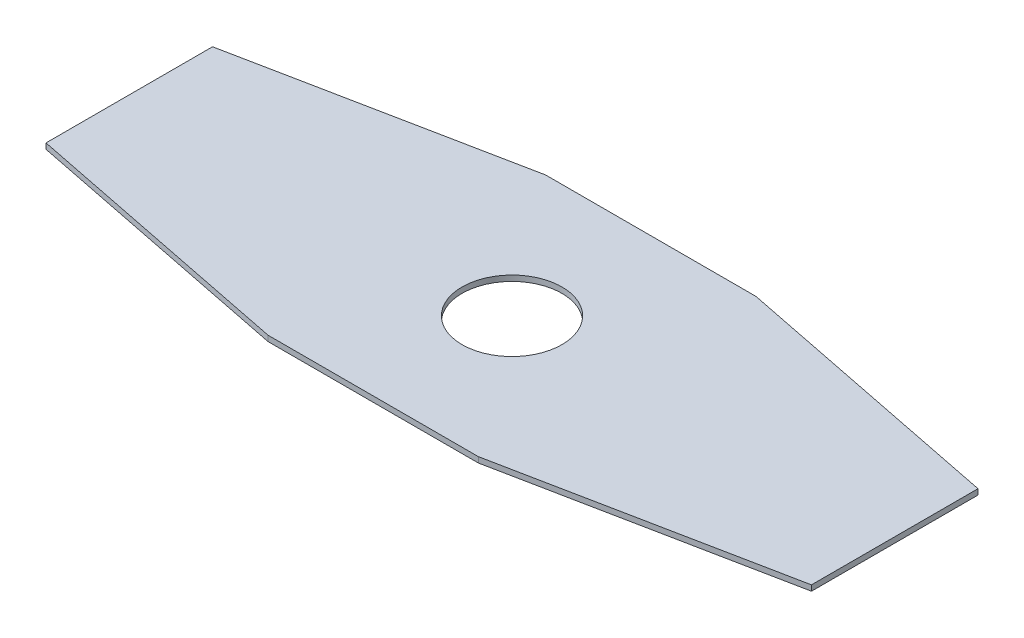
ISO-10303-21;
HEADER;
FILE_DESCRIPTION(('STEP AP214'),'2;1');
FILE_NAME('part.step','',(''),(''),'','','');
FILE_SCHEMA(('AUTOMOTIVE_DESIGN { 1 0 10303 214 1 1 1 1 }'));
ENDSEC;
DATA;
#1=APPLICATION_CONTEXT('core data for automotive mechanical design processes');
#2=APPLICATION_PROTOCOL_DEFINITION('international standard','automotive_design',2000,#1);
#3=PRODUCT_CONTEXT('',#1,'mechanical');
#4=PRODUCT('Part','Part','',(#3));
#5=PRODUCT_RELATED_PRODUCT_CATEGORY('part','',(#4));
#6=PRODUCT_DEFINITION_FORMATION('','',#4);
#7=PRODUCT_DEFINITION_CONTEXT('part definition',#1,'design');
#8=PRODUCT_DEFINITION('design','',#6,#7);
#9=PRODUCT_DEFINITION_SHAPE('','',#8);
#10=(LENGTH_UNIT() NAMED_UNIT(*) SI_UNIT(.MILLI.,.METRE.));
#11=(NAMED_UNIT(*) PLANE_ANGLE_UNIT() SI_UNIT($,.RADIAN.));
#12=(NAMED_UNIT(*) SI_UNIT($,.STERADIAN.) SOLID_ANGLE_UNIT());
#13=UNCERTAINTY_MEASURE_WITH_UNIT(LENGTH_MEASURE(1.E-05),#10,'distance_accuracy_value','');
#14=(GEOMETRIC_REPRESENTATION_CONTEXT(3) GLOBAL_UNCERTAINTY_ASSIGNED_CONTEXT((#13)) GLOBAL_UNIT_ASSIGNED_CONTEXT((#10,
#11,#12)) REPRESENTATION_CONTEXT('',''));
#15=CARTESIAN_POINT('',(0.,0.,0.));
#16=DIRECTION('',(0.,0.,1.));
#17=DIRECTION('',(1.,0.,0.));
#18=AXIS2_PLACEMENT_3D('',#15,#16,#17);
#19=CARTESIAN_POINT('',(-18.9450952168784,1.,25.));
#20=DIRECTION('',(0.196116135138184,0.,-0.98058067569092));
#21=DIRECTION('',(0.98058067569092,0.,0.196116135138184));
#22=AXIS2_PLACEMENT_3D('',#19,#20,#21);
#23=PLANE('',#22);
#24=DIRECTION('',(0.,1.,0.));
#25=VECTOR('',#24,1.);
#26=CARTESIAN_POINT('',(-68.9450952168784,1.,15.));
#27=LINE('',#26,#25);
#28=CARTESIAN_POINT('',(-68.9450952168783,0.,15.));
#29=VERTEX_POINT('',#28);
#30=CARTESIAN_POINT('',(-68.9450952168784,1.,15.));
#31=VERTEX_POINT('',#30);
#32=EDGE_CURVE('E11',#29,#31,#27,.T.);
#33=ORIENTED_EDGE('',*,*,#32,.F.);
#34=DIRECTION('',(0.98058067569092,0.,0.196116135138184));
#35=VECTOR('',#34,1.);
#36=CARTESIAN_POINT('',(-18.9450952168784,0.,25.));
#37=LINE('',#36,#35);
#38=CARTESIAN_POINT('',(-18.9450952168784,0.,25.));
#39=VERTEX_POINT('',#38);
#40=EDGE_CURVE('E110',#29,#39,#37,.T.);
#41=ORIENTED_EDGE('',*,*,#40,.T.);
#42=DIRECTION('',(0.,1.,0.));
#43=VECTOR('',#42,1.);
#44=CARTESIAN_POINT('',(-18.9450952168784,1.,25.));
#45=LINE('',#44,#43);
#46=CARTESIAN_POINT('',(-18.9450952168784,1.,25.));
#47=VERTEX_POINT('',#46);
#48=EDGE_CURVE('E51',#39,#47,#45,.T.);
#49=ORIENTED_EDGE('',*,*,#48,.T.);
#50=DIRECTION('',(0.98058067569092,0.,0.196116135138184));
#51=VECTOR('',#50,1.);
#52=CARTESIAN_POINT('',(-18.9450952168784,1.,25.));
#53=LINE('',#52,#51);
#54=EDGE_CURVE('E152',#31,#47,#53,.T.);
#55=ORIENTED_EDGE('',*,*,#54,.F.);
#56=EDGE_LOOP('',(#33,#41,#49,#55));
#57=FACE_BOUND('',#56,.T.);
#58=ADVANCED_FACE('F41',(#57),#23,.F.);
#59=CARTESIAN_POINT('',(18.9450952168784,1.,25.));
#60=DIRECTION('',(0.,0.,-1.));
#61=DIRECTION('',(1.,0.,0.));
#62=AXIS2_PLACEMENT_3D('',#59,#60,#61);
#63=PLANE('',#62);
#64=ORIENTED_EDGE('',*,*,#48,.F.);
#65=DIRECTION('',(1.,0.,0.));
#66=VECTOR('',#65,1.);
#67=CARTESIAN_POINT('',(0.,0.,25.));
#68=LINE('',#67,#66);
#69=CARTESIAN_POINT('',(18.9450952168784,0.,25.));
#70=VERTEX_POINT('',#69);
#71=EDGE_CURVE('E129',#39,#70,#68,.T.);
#72=ORIENTED_EDGE('',*,*,#71,.T.);
#73=DIRECTION('',(0.,1.,0.));
#74=VECTOR('',#73,1.);
#75=CARTESIAN_POINT('',(18.9450952168784,1.,25.));
#76=LINE('',#75,#74);
#77=CARTESIAN_POINT('',(18.9450952168784,1.,25.));
#78=VERTEX_POINT('',#77);
#79=EDGE_CURVE('E145',#70,#78,#76,.T.);
#80=ORIENTED_EDGE('',*,*,#79,.T.);
#81=DIRECTION('',(1.,0.,0.));
#82=VECTOR('',#81,1.);
#83=CARTESIAN_POINT('',(18.9450952168784,1.,25.));
#84=LINE('',#83,#82);
#85=EDGE_CURVE('E162',#47,#78,#84,.T.);
#86=ORIENTED_EDGE('',*,*,#85,.F.);
#87=EDGE_LOOP('',(#64,#72,#80,#86));
#88=FACE_BOUND('',#87,.T.);
#89=ADVANCED_FACE('F165',(#88),#63,.F.);
#90=CARTESIAN_POINT('',(68.9450952168784,1.,15.));
#91=DIRECTION('',(-0.196116135138184,0.,-0.98058067569092));
#92=DIRECTION('',(0.98058067569092,0.,-0.196116135138184));
#93=AXIS2_PLACEMENT_3D('',#90,#91,#92);
#94=PLANE('',#93);
#95=ORIENTED_EDGE('',*,*,#79,.F.);
#96=DIRECTION('',(0.98058067569092,0.,-0.196116135138184));
#97=VECTOR('',#96,1.);
#98=CARTESIAN_POINT('',(68.9450952168784,0.,15.));
#99=LINE('',#98,#97);
#100=CARTESIAN_POINT('',(68.9450952168783,0.,15.));
#101=VERTEX_POINT('',#100);
#102=EDGE_CURVE('E126',#70,#101,#99,.T.);
#103=ORIENTED_EDGE('',*,*,#102,.T.);
#104=DIRECTION('',(0.,1.,0.));
#105=VECTOR('',#104,1.);
#106=CARTESIAN_POINT('',(68.9450952168784,1.,15.));
#107=LINE('',#106,#105);
#108=CARTESIAN_POINT('',(68.9450952168784,1.,15.));
#109=VERTEX_POINT('',#108);
#110=EDGE_CURVE('E142',#101,#109,#107,.T.);
#111=ORIENTED_EDGE('',*,*,#110,.T.);
#112=DIRECTION('',(0.98058067569092,0.,-0.196116135138184));
#113=VECTOR('',#112,1.);
#114=CARTESIAN_POINT('',(68.9450952168784,1.,15.));
#115=LINE('',#114,#113);
#116=EDGE_CURVE('E166',#78,#109,#115,.T.);
#117=ORIENTED_EDGE('',*,*,#116,.F.);
#118=EDGE_LOOP('',(#95,#103,#111,#117));
#119=FACE_BOUND('',#118,.T.);
#120=ADVANCED_FACE('F198',(#119),#94,.F.);
#121=CARTESIAN_POINT('',(68.9450952168784,1.,-15.));
#122=DIRECTION('',(-1.,0.,0.));
#123=DIRECTION('',(0.,0.,-1.));
#124=AXIS2_PLACEMENT_3D('',#121,#122,#123);
#125=PLANE('',#124);
#126=ORIENTED_EDGE('',*,*,#110,.F.);
#127=DIRECTION('',(0.,0.,-1.));
#128=VECTOR('',#127,1.);
#129=CARTESIAN_POINT('',(68.9450952168783,0.,0.));
#130=LINE('',#129,#128);
#131=CARTESIAN_POINT('',(68.9450952168783,0.,-15.));
#132=VERTEX_POINT('',#131);
#133=EDGE_CURVE('E123',#101,#132,#130,.T.);
#134=ORIENTED_EDGE('',*,*,#133,.T.);
#135=DIRECTION('',(0.,1.,0.));
#136=VECTOR('',#135,1.);
#137=CARTESIAN_POINT('',(68.9450952168784,1.,-15.));
#138=LINE('',#137,#136);
#139=CARTESIAN_POINT('',(68.9450952168784,1.,-15.));
#140=VERTEX_POINT('',#139);
#141=EDGE_CURVE('E139',#132,#140,#138,.T.);
#142=ORIENTED_EDGE('',*,*,#141,.T.);
#143=DIRECTION('',(0.,0.,-1.));
#144=VECTOR('',#143,1.);
#145=CARTESIAN_POINT('',(68.9450952168784,1.,-15.));
#146=LINE('',#145,#144);
#147=EDGE_CURVE('E168',#109,#140,#146,.T.);
#148=ORIENTED_EDGE('',*,*,#147,.F.);
#149=EDGE_LOOP('',(#126,#134,#142,#148));
#150=FACE_BOUND('',#149,.T.);
#151=ADVANCED_FACE('F215',(#150),#125,.F.);
#152=CARTESIAN_POINT('',(18.9450952168784,1.,-25.));
#153=DIRECTION('',(-0.196116135138184,0.,0.98058067569092));
#154=DIRECTION('',(-0.98058067569092,0.,-0.196116135138184));
#155=AXIS2_PLACEMENT_3D('',#152,#153,#154);
#156=PLANE('',#155);
#157=ORIENTED_EDGE('',*,*,#141,.F.);
#158=DIRECTION('',(-0.98058067569092,0.,-0.196116135138184));
#159=VECTOR('',#158,1.);
#160=CARTESIAN_POINT('',(18.9450952168784,0.,-25.));
#161=LINE('',#160,#159);
#162=CARTESIAN_POINT('',(18.9450952168784,0.,-25.));
#163=VERTEX_POINT('',#162);
#164=EDGE_CURVE('E120',#132,#163,#161,.T.);
#165=ORIENTED_EDGE('',*,*,#164,.T.);
#166=DIRECTION('',(0.,1.,0.));
#167=VECTOR('',#166,1.);
#168=CARTESIAN_POINT('',(18.9450952168784,1.,-25.));
#169=LINE('',#168,#167);
#170=CARTESIAN_POINT('',(18.9450952168784,1.,-25.));
#171=VERTEX_POINT('',#170);
#172=EDGE_CURVE('E137',#163,#171,#169,.T.);
#173=ORIENTED_EDGE('',*,*,#172,.T.);
#174=DIRECTION('',(-0.98058067569092,0.,-0.196116135138184));
#175=VECTOR('',#174,1.);
#176=CARTESIAN_POINT('',(18.9450952168784,1.,-25.));
#177=LINE('',#176,#175);
#178=EDGE_CURVE('E174',#140,#171,#177,.T.);
#179=ORIENTED_EDGE('',*,*,#178,.F.);
#180=EDGE_LOOP('',(#157,#165,#173,#179));
#181=FACE_BOUND('',#180,.T.);
#182=ADVANCED_FACE('F210',(#181),#156,.F.);
#183=CARTESIAN_POINT('',(-18.9450952168784,1.,-25.));
#184=DIRECTION('',(0.,0.,1.));
#185=DIRECTION('',(-1.,0.,0.));
#186=AXIS2_PLACEMENT_3D('',#183,#184,#185);
#187=PLANE('',#186);
#188=ORIENTED_EDGE('',*,*,#172,.F.);
#189=DIRECTION('',(1.,0.,0.));
#190=VECTOR('',#189,1.);
#191=CARTESIAN_POINT('',(0.,0.,-25.));
#192=LINE('',#191,#190);
#193=CARTESIAN_POINT('',(-18.9450952168784,0.,-25.));
#194=VERTEX_POINT('',#193);
#195=EDGE_CURVE('E117',#163,#194,#192,.F.);
#196=ORIENTED_EDGE('',*,*,#195,.T.);
#197=DIRECTION('',(0.,1.,0.));
#198=VECTOR('',#197,1.);
#199=CARTESIAN_POINT('',(-18.9450952168784,1.,-25.));
#200=LINE('',#199,#198);
#201=CARTESIAN_POINT('',(-18.9450952168784,1.,-25.));
#202=VERTEX_POINT('',#201);
#203=EDGE_CURVE('E59',#194,#202,#200,.T.);
#204=ORIENTED_EDGE('',*,*,#203,.T.);
#205=DIRECTION('',(-1.,0.,0.));
#206=VECTOR('',#205,1.);
#207=CARTESIAN_POINT('',(-18.9450952168784,1.,-25.));
#208=LINE('',#207,#206);
#209=EDGE_CURVE('E176',#171,#202,#208,.T.);
#210=ORIENTED_EDGE('',*,*,#209,.F.);
#211=EDGE_LOOP('',(#188,#196,#204,#210));
#212=FACE_BOUND('',#211,.T.);
#213=ADVANCED_FACE('F205',(#212),#187,.F.);
#214=CARTESIAN_POINT('',(-68.9450952168784,1.,-15.));
#215=DIRECTION('',(0.196116135138184,0.,0.98058067569092));
#216=DIRECTION('',(-0.98058067569092,0.,0.196116135138184));
#217=AXIS2_PLACEMENT_3D('',#214,#215,#216);
#218=PLANE('',#217);
#219=ORIENTED_EDGE('',*,*,#203,.F.);
#220=DIRECTION('',(-0.98058067569092,0.,0.196116135138184));
#221=VECTOR('',#220,1.);
#222=CARTESIAN_POINT('',(-68.9450952168784,0.,-15.));
#223=LINE('',#222,#221);
#224=CARTESIAN_POINT('',(-68.9450952168783,0.,-15.));
#225=VERTEX_POINT('',#224);
#226=EDGE_CURVE('E108',#194,#225,#223,.T.);
#227=ORIENTED_EDGE('',*,*,#226,.T.);
#228=DIRECTION('',(0.,1.,0.));
#229=VECTOR('',#228,1.);
#230=CARTESIAN_POINT('',(-68.9450952168784,1.,-15.));
#231=LINE('',#230,#229);
#232=CARTESIAN_POINT('',(-68.9450952168784,1.,-15.));
#233=VERTEX_POINT('',#232);
#234=EDGE_CURVE('E45',#225,#233,#231,.T.);
#235=ORIENTED_EDGE('',*,*,#234,.T.);
#236=DIRECTION('',(-0.98058067569092,0.,0.196116135138184));
#237=VECTOR('',#236,1.);
#238=CARTESIAN_POINT('',(-68.9450952168784,1.,-15.));
#239=LINE('',#238,#237);
#240=EDGE_CURVE('E135',#202,#233,#239,.T.);
#241=ORIENTED_EDGE('',*,*,#240,.F.);
#242=EDGE_LOOP('',(#219,#227,#235,#241));
#243=FACE_BOUND('',#242,.T.);
#244=ADVANCED_FACE('F112',(#243),#218,.F.);
#245=CARTESIAN_POINT('',(-68.9450952168784,1.,15.));
#246=DIRECTION('',(1.,0.,0.));
#247=DIRECTION('',(0.,0.,1.));
#248=AXIS2_PLACEMENT_3D('',#245,#246,#247);
#249=PLANE('',#248);
#250=DIRECTION('',(0.,0.,-1.));
#251=VECTOR('',#250,1.);
#252=CARTESIAN_POINT('',(-68.9450952168783,0.,0.));
#253=LINE('',#252,#251);
#254=EDGE_CURVE('E96',#225,#29,#253,.F.);
#255=ORIENTED_EDGE('',*,*,#254,.T.);
#256=ORIENTED_EDGE('',*,*,#32,.T.);
#257=DIRECTION('',(0.,0.,1.));
#258=VECTOR('',#257,1.);
#259=CARTESIAN_POINT('',(-68.9450952168784,1.,15.));
#260=LINE('',#259,#258);
#261=EDGE_CURVE('E98',#233,#31,#260,.T.);
#262=ORIENTED_EDGE('',*,*,#261,.F.);
#263=ORIENTED_EDGE('',*,*,#234,.F.);
#264=EDGE_LOOP('',(#255,#256,#262,#263));
#265=FACE_BOUND('',#264,.T.);
#266=ADVANCED_FACE('F95',(#265),#249,.F.);
#267=CARTESIAN_POINT('',(0.,1.,0.));
#268=DIRECTION('',(0.,-1.,0.));
#269=DIRECTION('',(0.,0.,-1.));
#270=AXIS2_PLACEMENT_3D('',#267,#268,#269);
#271=CYLINDRICAL_SURFACE('',#270,9.);
#272=CARTESIAN_POINT('',(0.,1.,0.));
#273=DIRECTION('',(0.,1.,0.));
#274=DIRECTION('',(0.,0.,1.));
#275=AXIS2_PLACEMENT_3D('',#272,#273,#274);
#276=CIRCLE('',#275,9.);
#277=CARTESIAN_POINT('',(0.,1.,9.));
#278=VERTEX_POINT('',#277);
#279=EDGE_CURVE('E102',#278,#278,#276,.T.);
#280=ORIENTED_EDGE('',*,*,#279,.T.);
#281=EDGE_LOOP('',(#280));
#282=FACE_BOUND('',#281,.T.);
#283=CARTESIAN_POINT('',(0.,0.,0.));
#284=DIRECTION('',(0.,1.,0.));
#285=DIRECTION('',(0.,0.,1.));
#286=AXIS2_PLACEMENT_3D('',#283,#284,#285);
#287=CIRCLE('',#286,9.);
#288=CARTESIAN_POINT('',(0.,0.,9.));
#289=VERTEX_POINT('',#288);
#290=EDGE_CURVE('E119',#289,#289,#287,.T.);
#291=ORIENTED_EDGE('',*,*,#290,.F.);
#292=EDGE_LOOP('',(#291));
#293=FACE_BOUND('',#292,.T.);
#294=ADVANCED_FACE('F43',(#282,#293),#271,.F.);
#295=CARTESIAN_POINT('',(0.,1.,0.));
#296=DIRECTION('',(0.,-1.,0.));
#297=DIRECTION('',(0.,0.,-1.));
#298=AXIS2_PLACEMENT_3D('',#295,#296,#297);
#299=PLANE('',#298);
#300=ORIENTED_EDGE('',*,*,#240,.T.);
#301=ORIENTED_EDGE('',*,*,#261,.T.);
#302=ORIENTED_EDGE('',*,*,#54,.T.);
#303=ORIENTED_EDGE('',*,*,#85,.T.);
#304=ORIENTED_EDGE('',*,*,#116,.T.);
#305=ORIENTED_EDGE('',*,*,#147,.T.);
#306=ORIENTED_EDGE('',*,*,#178,.T.);
#307=ORIENTED_EDGE('',*,*,#209,.T.);
#308=EDGE_LOOP('',(#300,#301,#302,#303,#304,#305,#306,#307));
#309=FACE_BOUND('',#308,.T.);
#310=ORIENTED_EDGE('',*,*,#279,.F.);
#311=EDGE_LOOP('',(#310));
#312=FACE_BOUND('',#311,.T.);
#313=ADVANCED_FACE('F159',(#309,#312),#299,.F.);
#314=CARTESIAN_POINT('',(0.,0.,0.));
#315=DIRECTION('',(0.,-1.,0.));
#316=DIRECTION('',(0.,0.,-1.));
#317=AXIS2_PLACEMENT_3D('',#314,#315,#316);
#318=PLANE('',#317);
#319=ORIENTED_EDGE('',*,*,#226,.F.);
#320=ORIENTED_EDGE('',*,*,#195,.F.);
#321=ORIENTED_EDGE('',*,*,#164,.F.);
#322=ORIENTED_EDGE('',*,*,#133,.F.);
#323=ORIENTED_EDGE('',*,*,#102,.F.);
#324=ORIENTED_EDGE('',*,*,#71,.F.);
#325=ORIENTED_EDGE('',*,*,#40,.F.);
#326=ORIENTED_EDGE('',*,*,#254,.F.);
#327=EDGE_LOOP('',(#319,#320,#321,#322,#323,#324,#325,#326));
#328=FACE_BOUND('',#327,.T.);
#329=ORIENTED_EDGE('',*,*,#290,.T.);
#330=EDGE_LOOP('',(#329));
#331=FACE_BOUND('',#330,.T.);
#332=ADVANCED_FACE('F105',(#328,#331),#318,.T.);
#333=CLOSED_SHELL('',(#58,#89,#120,#151,#182,#213,#244,#266,#294,#313,#332));
#334=MANIFOLD_SOLID_BREP('B2',#333);
#335=ADVANCED_BREP_SHAPE_REPRESENTATION('',(#18,#334),#14);
#336=SHAPE_DEFINITION_REPRESENTATION(#9,#335);
ENDSEC;
END-ISO-10303-21;
